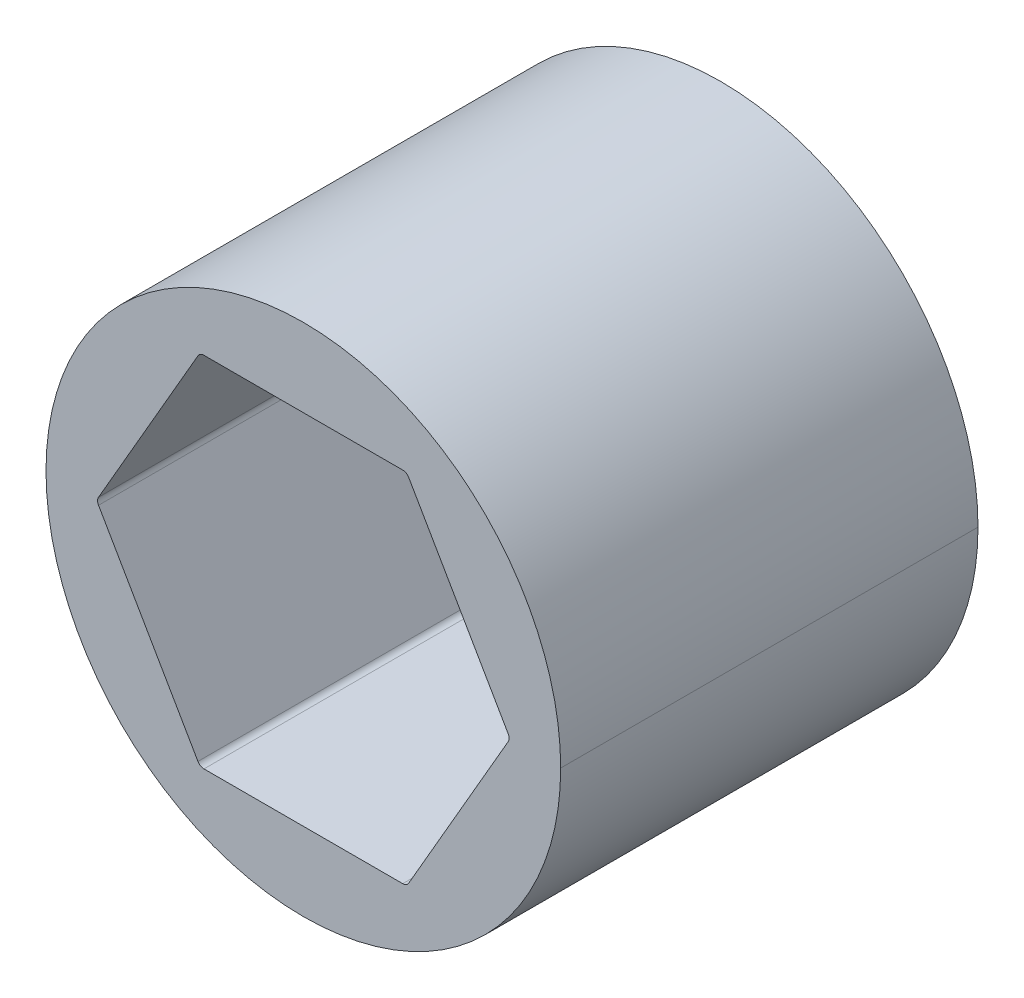
ISO-10303-21;
HEADER;
FILE_DESCRIPTION(('STEP AP214'),'2;1');
FILE_NAME('part.step','',(''),(''),'','','');
FILE_SCHEMA(('AUTOMOTIVE_DESIGN { 1 0 10303 214 1 1 1 1 }'));
ENDSEC;
DATA;
#1=APPLICATION_CONTEXT('core data for automotive mechanical design processes');
#2=APPLICATION_PROTOCOL_DEFINITION('international standard','automotive_design',2000,#1);
#3=PRODUCT_CONTEXT('',#1,'mechanical');
#4=PRODUCT('Part','Part','',(#3));
#5=PRODUCT_RELATED_PRODUCT_CATEGORY('part','',(#4));
#6=PRODUCT_DEFINITION_FORMATION('','',#4);
#7=PRODUCT_DEFINITION_CONTEXT('part definition',#1,'design');
#8=PRODUCT_DEFINITION('design','',#6,#7);
#9=PRODUCT_DEFINITION_SHAPE('','',#8);
#10=(LENGTH_UNIT() NAMED_UNIT(*) SI_UNIT(.MILLI.,.METRE.));
#11=(NAMED_UNIT(*) PLANE_ANGLE_UNIT() SI_UNIT($,.RADIAN.));
#12=(NAMED_UNIT(*) SI_UNIT($,.STERADIAN.) SOLID_ANGLE_UNIT());
#13=UNCERTAINTY_MEASURE_WITH_UNIT(LENGTH_MEASURE(1.E-05),#10,'distance_accuracy_value','');
#14=(GEOMETRIC_REPRESENTATION_CONTEXT(3) GLOBAL_UNCERTAINTY_ASSIGNED_CONTEXT((#13)) GLOBAL_UNIT_ASSIGNED_CONTEXT((#10,
#11,#12)) REPRESENTATION_CONTEXT('',''));
#15=CARTESIAN_POINT('',(0.,0.,0.));
#16=DIRECTION('',(0.,0.,1.));
#17=DIRECTION('',(1.,0.,0.));
#18=AXIS2_PLACEMENT_3D('',#15,#16,#17);
#19=CARTESIAN_POINT('',(7.25902493452117,0.,30.48));
#20=DIRECTION('',(0.,0.,1.));
#21=DIRECTION('',(1.,0.,0.));
#22=AXIS2_PLACEMENT_3D('',#19,#20,#21);
#23=CYLINDRICAL_SURFACE('',#22,0.254);
#24=CARTESIAN_POINT('',(7.25902493452117,0.,15.24));
#25=DIRECTION('',(0.,0.,1.));
#26=DIRECTION('',(1.,0.,0.));
#27=AXIS2_PLACEMENT_3D('',#24,#25,#26);
#28=CIRCLE('',#27,0.254);
#29=CARTESIAN_POINT('',(7.47899538708242,0.127,15.24));
#30=VERTEX_POINT('',#29);
#31=CARTESIAN_POINT('',(7.51302493452117,0.,15.24));
#32=VERTEX_POINT('',#31);
#33=EDGE_CURVE('E303',#30,#32,#28,.F.);
#34=ORIENTED_EDGE('',*,*,#33,.F.);
#35=DIRECTION('',(0.,0.,1.));
#36=VECTOR('',#35,1.);
#37=CARTESIAN_POINT('',(7.47899538708242,0.127,30.48));
#38=LINE('',#37,#36);
#39=CARTESIAN_POINT('',(7.47899538708242,0.127,0.));
#40=VERTEX_POINT('',#39);
#41=EDGE_CURVE('E269',#40,#30,#38,.T.);
#42=ORIENTED_EDGE('',*,*,#41,.F.);
#43=CARTESIAN_POINT('',(7.25902493452117,0.,0.));
#44=DIRECTION('',(0.,0.,1.));
#45=DIRECTION('',(1.,0.,0.));
#46=AXIS2_PLACEMENT_3D('',#43,#44,#45);
#47=CIRCLE('',#46,0.254);
#48=CARTESIAN_POINT('',(7.51302493452117,0.,0.));
#49=VERTEX_POINT('',#48);
#50=EDGE_CURVE('E201',#49,#40,#47,.T.);
#51=ORIENTED_EDGE('',*,*,#50,.F.);
#52=DIRECTION('',(0.,0.,1.));
#53=VECTOR('',#52,1.);
#54=CARTESIAN_POINT('',(7.51302493452117,0.,30.48));
#55=LINE('',#54,#53);
#56=EDGE_CURVE('E54',#49,#32,#55,.T.);
#57=ORIENTED_EDGE('',*,*,#56,.T.);
#58=EDGE_LOOP('',(#34,#42,#51,#57));
#59=FACE_BOUND('',#58,.T.);
#60=ADVANCED_FACE('F45',(#59),#23,.F.);
#61=CARTESIAN_POINT('',(0.,0.,30.48));
#62=DIRECTION('',(0.,0.,-1.));
#63=DIRECTION('',(-1.,0.,0.));
#64=AXIS2_PLACEMENT_3D('',#61,#62,#63);
#65=CYLINDRICAL_SURFACE('',#64,9.398);
#66=DIRECTION('',(0.,0.,-1.));
#67=VECTOR('',#66,1.);
#68=CARTESIAN_POINT('',(-9.398,0.,30.48));
#69=LINE('',#68,#67);
#70=CARTESIAN_POINT('',(-9.398,0.,15.24));
#71=VERTEX_POINT('',#70);
#72=CARTESIAN_POINT('',(-9.398,0.,0.));
#73=VERTEX_POINT('',#72);
#74=EDGE_CURVE('E176',#71,#73,#69,.T.);
#75=ORIENTED_EDGE('',*,*,#74,.F.);
#76=CARTESIAN_POINT('',(0.,0.,15.24));
#77=DIRECTION('',(0.,0.,1.));
#78=DIRECTION('',(1.,0.,0.));
#79=AXIS2_PLACEMENT_3D('',#76,#77,#78);
#80=CIRCLE('',#79,9.398);
#81=CARTESIAN_POINT('',(9.398,0.,15.24));
#82=VERTEX_POINT('',#81);
#83=EDGE_CURVE('E60',#82,#71,#80,.T.);
#84=ORIENTED_EDGE('',*,*,#83,.F.);
#85=DIRECTION('',(0.,0.,-1.));
#86=VECTOR('',#85,1.);
#87=CARTESIAN_POINT('',(9.398,0.,30.48));
#88=LINE('',#87,#86);
#89=CARTESIAN_POINT('',(9.398,0.,0.));
#90=VERTEX_POINT('',#89);
#91=EDGE_CURVE('E174',#82,#90,#88,.T.);
#92=ORIENTED_EDGE('',*,*,#91,.T.);
#93=CARTESIAN_POINT('',(0.,0.,0.));
#94=DIRECTION('',(0.,0.,1.));
#95=DIRECTION('',(1.,0.,0.));
#96=AXIS2_PLACEMENT_3D('',#93,#94,#95);
#97=CIRCLE('',#96,9.398);
#98=EDGE_CURVE('E183',#90,#73,#97,.T.);
#99=ORIENTED_EDGE('',*,*,#98,.T.);
#100=EDGE_LOOP('',(#75,#84,#92,#99));
#101=FACE_BOUND('',#100,.T.);
#102=ADVANCED_FACE('F172',(#101),#65,.T.);
#103=CARTESIAN_POINT('',(0.,0.,30.48));
#104=DIRECTION('',(0.,0.,-1.));
#105=DIRECTION('',(-1.,0.,0.));
#106=AXIS2_PLACEMENT_3D('',#103,#104,#105);
#107=CYLINDRICAL_SURFACE('',#106,9.398);
#108=ORIENTED_EDGE('',*,*,#91,.F.);
#109=EDGE_CURVE('E164',#71,#82,#80,.T.);
#110=ORIENTED_EDGE('',*,*,#109,.F.);
#111=ORIENTED_EDGE('',*,*,#74,.T.);
#112=CARTESIAN_POINT('',(0.,0.,0.));
#113=DIRECTION('',(0.,0.,1.));
#114=DIRECTION('',(1.,0.,0.));
#115=AXIS2_PLACEMENT_3D('',#112,#113,#114);
#116=CIRCLE('',#115,9.398);
#117=EDGE_CURVE('E181',#73,#90,#116,.T.);
#118=ORIENTED_EDGE('',*,*,#117,.T.);
#119=EDGE_LOOP('',(#108,#110,#111,#118));
#120=FACE_BOUND('',#119,.T.);
#121=ADVANCED_FACE('F179',(#120),#107,.T.);
#122=CARTESIAN_POINT('',(3.77615943563475,-6.5405,30.48));
#123=DIRECTION('',(-0.866025403784439,0.5,0.));
#124=DIRECTION('',(0.,0.,1.));
#125=AXIS2_PLACEMENT_3D('',#122,#123,#124);
#126=PLANE('',#125);
#127=DIRECTION('',(0.,0.,1.));
#128=VECTOR('',#127,1.);
#129=CARTESIAN_POINT('',(3.84948291982184,-6.4135,30.48));
#130=LINE('',#129,#128);
#131=CARTESIAN_POINT('',(3.84948291982184,-6.4135,0.));
#132=VERTEX_POINT('',#131);
#133=CARTESIAN_POINT('',(3.84948291982184,-6.4135,15.24));
#134=VERTEX_POINT('',#133);
#135=EDGE_CURVE('E220',#132,#134,#130,.T.);
#136=ORIENTED_EDGE('',*,*,#135,.T.);
#137=DIRECTION('',(0.5,0.866025403784439,0.));
#138=VECTOR('',#137,1.);
#139=CARTESIAN_POINT('',(3.77615943563475,-6.5405,15.24));
#140=LINE('',#139,#138);
#141=CARTESIAN_POINT('',(7.47899538708242,-0.127000000000001,15.24));
#142=VERTEX_POINT('',#141);
#143=EDGE_CURVE('E313',#134,#142,#140,.T.);
#144=ORIENTED_EDGE('',*,*,#143,.T.);
#145=DIRECTION('',(0.,0.,-1.));
#146=VECTOR('',#145,1.);
#147=CARTESIAN_POINT('',(7.47899538708242,-0.127,0.));
#148=LINE('',#147,#146);
#149=CARTESIAN_POINT('',(7.47899538708242,-0.127000000000001,0.));
#150=VERTEX_POINT('',#149);
#151=EDGE_CURVE('E224',#142,#150,#148,.T.);
#152=ORIENTED_EDGE('',*,*,#151,.T.);
#153=DIRECTION('',(0.5,0.866025403784439,0.));
#154=VECTOR('',#153,1.);
#155=CARTESIAN_POINT('',(3.77615943563475,-6.5405,0.));
#156=LINE('',#155,#154);
#157=EDGE_CURVE('E200',#132,#150,#156,.T.);
#158=ORIENTED_EDGE('',*,*,#157,.F.);
#159=EDGE_LOOP('',(#136,#144,#152,#158));
#160=FACE_BOUND('',#159,.T.);
#161=ADVANCED_FACE('F465',(#160),#126,.T.);
#162=CARTESIAN_POINT('',(7.5523188712695,0.,30.48));
#163=DIRECTION('',(-0.866025403784438,-0.5,0.));
#164=DIRECTION('',(-0.5,0.866025403784438,0.));
#165=AXIS2_PLACEMENT_3D('',#162,#163,#164);
#166=PLANE('',#165);
#167=ORIENTED_EDGE('',*,*,#41,.T.);
#168=DIRECTION('',(-0.5,0.866025403784438,0.));
#169=VECTOR('',#168,1.);
#170=CARTESIAN_POINT('',(7.5523188712695,0.,15.24));
#171=LINE('',#170,#169);
#172=CARTESIAN_POINT('',(3.84948291982183,6.4135,15.24));
#173=VERTEX_POINT('',#172);
#174=EDGE_CURVE('E298',#30,#173,#171,.T.);
#175=ORIENTED_EDGE('',*,*,#174,.T.);
#176=DIRECTION('',(0.,0.,-1.));
#177=VECTOR('',#176,1.);
#178=CARTESIAN_POINT('',(3.84948291982183,6.4135,0.));
#179=LINE('',#178,#177);
#180=CARTESIAN_POINT('',(3.84948291982183,6.4135,0.));
#181=VERTEX_POINT('',#180);
#182=EDGE_CURVE('E230',#173,#181,#179,.T.);
#183=ORIENTED_EDGE('',*,*,#182,.T.);
#184=DIRECTION('',(-0.5,0.866025403784438,0.));
#185=VECTOR('',#184,1.);
#186=CARTESIAN_POINT('',(7.5523188712695,0.,0.));
#187=LINE('',#186,#185);
#188=EDGE_CURVE('E228',#40,#181,#187,.T.);
#189=ORIENTED_EDGE('',*,*,#188,.F.);
#190=EDGE_LOOP('',(#167,#175,#183,#189));
#191=FACE_BOUND('',#190,.T.);
#192=ADVANCED_FACE('F297',(#191),#166,.T.);
#193=CARTESIAN_POINT('',(3.77615943563475,6.5405,30.48));
#194=DIRECTION('',(0.,-1.,0.));
#195=DIRECTION('',(0.,0.,-1.));
#196=AXIS2_PLACEMENT_3D('',#193,#194,#195);
#197=PLANE('',#196);
#198=DIRECTION('',(0.,0.,1.));
#199=VECTOR('',#198,1.);
#200=CARTESIAN_POINT('',(3.62951246726058,6.5405,30.48));
#201=LINE('',#200,#199);
#202=CARTESIAN_POINT('',(3.62951246726058,6.5405,0.));
#203=VERTEX_POINT('',#202);
#204=CARTESIAN_POINT('',(3.62951246726058,6.5405,15.24));
#205=VERTEX_POINT('',#204);
#206=EDGE_CURVE('E265',#203,#205,#201,.T.);
#207=ORIENTED_EDGE('',*,*,#206,.T.);
#208=DIRECTION('',(-1.,0.,0.));
#209=VECTOR('',#208,1.);
#210=CARTESIAN_POINT('',(3.77615943563475,6.5405,15.24));
#211=LINE('',#210,#209);
#212=CARTESIAN_POINT('',(-3.62951246726058,6.5405,15.24));
#213=VERTEX_POINT('',#212);
#214=EDGE_CURVE('E325',#205,#213,#211,.T.);
#215=ORIENTED_EDGE('',*,*,#214,.T.);
#216=DIRECTION('',(0.,0.,-1.));
#217=VECTOR('',#216,1.);
#218=CARTESIAN_POINT('',(-3.62951246726058,6.5405,0.));
#219=LINE('',#218,#217);
#220=CARTESIAN_POINT('',(-3.62951246726058,6.5405,0.));
#221=VERTEX_POINT('',#220);
#222=EDGE_CURVE('E270',#213,#221,#219,.T.);
#223=ORIENTED_EDGE('',*,*,#222,.T.);
#224=DIRECTION('',(-1.,0.,0.));
#225=VECTOR('',#224,1.);
#226=CARTESIAN_POINT('',(3.77615943563475,6.5405,0.));
#227=LINE('',#226,#225);
#228=EDGE_CURVE('E253',#203,#221,#227,.T.);
#229=ORIENTED_EDGE('',*,*,#228,.F.);
#230=EDGE_LOOP('',(#207,#215,#223,#229));
#231=FACE_BOUND('',#230,.T.);
#232=ADVANCED_FACE('F484',(#231),#197,.T.);
#233=CARTESIAN_POINT('',(-3.77615943563474,6.5405,30.48));
#234=DIRECTION('',(0.866025403784439,-0.5,0.));
#235=DIRECTION('',(0.,0.,-1.));
#236=AXIS2_PLACEMENT_3D('',#233,#234,#235);
#237=PLANE('',#236);
#238=DIRECTION('',(0.,0.,1.));
#239=VECTOR('',#238,1.);
#240=CARTESIAN_POINT('',(-3.84948291982183,6.4135,30.48));
#241=LINE('',#240,#239);
#242=CARTESIAN_POINT('',(-3.84948291982183,6.4135,0.));
#243=VERTEX_POINT('',#242);
#244=CARTESIAN_POINT('',(-3.84948291982183,6.4135,15.24));
#245=VERTEX_POINT('',#244);
#246=EDGE_CURVE('E194',#243,#245,#241,.T.);
#247=ORIENTED_EDGE('',*,*,#246,.T.);
#248=DIRECTION('',(-0.5,-0.866025403784439,0.));
#249=VECTOR('',#248,1.);
#250=CARTESIAN_POINT('',(-3.77615943563474,6.5405,15.24));
#251=LINE('',#250,#249);
#252=CARTESIAN_POINT('',(-7.47899538708242,0.127000000000006,15.24));
#253=VERTEX_POINT('',#252);
#254=EDGE_CURVE('E339',#245,#253,#251,.T.);
#255=ORIENTED_EDGE('',*,*,#254,.T.);
#256=DIRECTION('',(0.,0.,-1.));
#257=VECTOR('',#256,1.);
#258=CARTESIAN_POINT('',(-7.47899538708241,0.127000000000002,0.));
#259=LINE('',#258,#257);
#260=CARTESIAN_POINT('',(-7.47899538708241,0.127000000000003,0.));
#261=VERTEX_POINT('',#260);
#262=EDGE_CURVE('E243',#253,#261,#259,.T.);
#263=ORIENTED_EDGE('',*,*,#262,.T.);
#264=DIRECTION('',(-0.5,-0.866025403784439,0.));
#265=VECTOR('',#264,1.);
#266=CARTESIAN_POINT('',(-3.77615943563474,6.5405,0.));
#267=LINE('',#266,#265);
#268=EDGE_CURVE('E254',#243,#261,#267,.T.);
#269=ORIENTED_EDGE('',*,*,#268,.F.);
#270=EDGE_LOOP('',(#247,#255,#263,#269));
#271=FACE_BOUND('',#270,.T.);
#272=ADVANCED_FACE('F360',(#271),#237,.T.);
#273=CARTESIAN_POINT('',(-7.5523188712695,0.,30.48));
#274=DIRECTION('',(0.866025403784439,0.5,0.));
#275=DIRECTION('',(0.,0.,-1.));
#276=AXIS2_PLACEMENT_3D('',#273,#274,#275);
#277=PLANE('',#276);
#278=DIRECTION('',(0.,0.,1.));
#279=VECTOR('',#278,1.);
#280=CARTESIAN_POINT('',(-7.47899538708241,-0.126999999999998,30.48));
#281=LINE('',#280,#279);
#282=CARTESIAN_POINT('',(-7.47899538708241,-0.126999999999999,0.));
#283=VERTEX_POINT('',#282);
#284=CARTESIAN_POINT('',(-7.47899538708241,-0.126999999999998,15.24));
#285=VERTEX_POINT('',#284);
#286=EDGE_CURVE('E207',#283,#285,#281,.T.);
#287=ORIENTED_EDGE('',*,*,#286,.T.);
#288=DIRECTION('',(0.5,-0.866025403784439,0.));
#289=VECTOR('',#288,1.);
#290=CARTESIAN_POINT('',(-7.5523188712695,0.,15.24));
#291=LINE('',#290,#289);
#292=CARTESIAN_POINT('',(-3.84948291982184,-6.4135,15.24));
#293=VERTEX_POINT('',#292);
#294=EDGE_CURVE('E67',#285,#293,#291,.T.);
#295=ORIENTED_EDGE('',*,*,#294,.T.);
#296=DIRECTION('',(0.,0.,-1.));
#297=VECTOR('',#296,1.);
#298=CARTESIAN_POINT('',(-3.84948291982183,-6.4135,0.));
#299=LINE('',#298,#297);
#300=CARTESIAN_POINT('',(-3.84948291982183,-6.4135,0.));
#301=VERTEX_POINT('',#300);
#302=EDGE_CURVE('E211',#293,#301,#299,.T.);
#303=ORIENTED_EDGE('',*,*,#302,.T.);
#304=DIRECTION('',(0.5,-0.866025403784439,0.));
#305=VECTOR('',#304,1.);
#306=CARTESIAN_POINT('',(-7.5523188712695,0.,0.));
#307=LINE('',#306,#305);
#308=EDGE_CURVE('E219',#283,#301,#307,.T.);
#309=ORIENTED_EDGE('',*,*,#308,.F.);
#310=EDGE_LOOP('',(#287,#295,#303,#309));
#311=FACE_BOUND('',#310,.T.);
#312=ADVANCED_FACE('F346',(#311),#277,.T.);
#313=CARTESIAN_POINT('',(-3.77615943563474,-6.5405,30.48));
#314=DIRECTION('',(0.,1.,0.));
#315=DIRECTION('',(1.,0.,0.));
#316=AXIS2_PLACEMENT_3D('',#313,#314,#315);
#317=PLANE('',#316);
#318=DIRECTION('',(0.,0.,1.));
#319=VECTOR('',#318,1.);
#320=CARTESIAN_POINT('',(-3.62951246726058,-6.5405,30.48));
#321=LINE('',#320,#319);
#322=CARTESIAN_POINT('',(-3.62951246726058,-6.5405,0.));
#323=VERTEX_POINT('',#322);
#324=CARTESIAN_POINT('',(-3.62951246726058,-6.5405,15.24));
#325=VERTEX_POINT('',#324);
#326=EDGE_CURVE('E205',#323,#325,#321,.T.);
#327=ORIENTED_EDGE('',*,*,#326,.T.);
#328=DIRECTION('',(1.,0.,0.));
#329=VECTOR('',#328,1.);
#330=CARTESIAN_POINT('',(-3.77615943563474,-6.5405,15.24));
#331=LINE('',#330,#329);
#332=CARTESIAN_POINT('',(3.62951246726059,-6.5405,15.24));
#333=VERTEX_POINT('',#332);
#334=EDGE_CURVE('E329',#325,#333,#331,.T.);
#335=ORIENTED_EDGE('',*,*,#334,.T.);
#336=DIRECTION('',(0.,0.,-1.));
#337=VECTOR('',#336,1.);
#338=CARTESIAN_POINT('',(3.62951246726059,-6.5405,0.));
#339=LINE('',#338,#337);
#340=CARTESIAN_POINT('',(3.62951246726058,-6.5405,0.));
#341=VERTEX_POINT('',#340);
#342=EDGE_CURVE('E202',#333,#341,#339,.T.);
#343=ORIENTED_EDGE('',*,*,#342,.T.);
#344=DIRECTION('',(1.,0.,0.));
#345=VECTOR('',#344,1.);
#346=CARTESIAN_POINT('',(-3.77615943563474,-6.5405,0.));
#347=LINE('',#346,#345);
#348=EDGE_CURVE('E190',#323,#341,#347,.T.);
#349=ORIENTED_EDGE('',*,*,#348,.F.);
#350=EDGE_LOOP('',(#327,#335,#343,#349));
#351=FACE_BOUND('',#350,.T.);
#352=ADVANCED_FACE('F510',(#351),#317,.T.);
#353=CARTESIAN_POINT('',(3.62951246726058,6.2865,30.48));
#354=DIRECTION('',(0.,0.,1.));
#355=DIRECTION('',(1.,0.,0.));
#356=AXIS2_PLACEMENT_3D('',#353,#354,#355);
#357=CYLINDRICAL_SURFACE('',#356,0.254);
#358=CARTESIAN_POINT('',(3.62951246726058,6.2865,15.24));
#359=DIRECTION('',(0.,0.,1.));
#360=DIRECTION('',(1.,0.,0.));
#361=AXIS2_PLACEMENT_3D('',#358,#359,#360);
#362=CIRCLE('',#361,0.254);
#363=EDGE_CURVE('E319',#205,#173,#362,.F.);
#364=ORIENTED_EDGE('',*,*,#363,.F.);
#365=ORIENTED_EDGE('',*,*,#206,.F.);
#366=CARTESIAN_POINT('',(3.62951246726058,6.2865,0.));
#367=DIRECTION('',(0.,0.,1.));
#368=DIRECTION('',(1.,0.,0.));
#369=AXIS2_PLACEMENT_3D('',#366,#367,#368);
#370=CIRCLE('',#369,0.254);
#371=EDGE_CURVE('E258',#181,#203,#370,.T.);
#372=ORIENTED_EDGE('',*,*,#371,.F.);
#373=ORIENTED_EDGE('',*,*,#182,.F.);
#374=EDGE_LOOP('',(#364,#365,#372,#373));
#375=FACE_BOUND('',#374,.T.);
#376=ADVANCED_FACE('F519',(#375),#357,.F.);
#377=CARTESIAN_POINT('',(-3.62951246726058,6.2865,30.48));
#378=DIRECTION('',(0.,0.,1.));
#379=DIRECTION('',(1.,0.,0.));
#380=AXIS2_PLACEMENT_3D('',#377,#378,#379);
#381=CYLINDRICAL_SURFACE('',#380,0.254);
#382=CARTESIAN_POINT('',(-3.62951246726058,6.2865,15.24));
#383=DIRECTION('',(0.,0.,1.));
#384=DIRECTION('',(1.,0.,0.));
#385=AXIS2_PLACEMENT_3D('',#382,#383,#384);
#386=CIRCLE('',#385,0.254);
#387=EDGE_CURVE('E333',#245,#213,#386,.F.);
#388=ORIENTED_EDGE('',*,*,#387,.F.);
#389=ORIENTED_EDGE('',*,*,#246,.F.);
#390=CARTESIAN_POINT('',(-3.62951246726058,6.2865,0.));
#391=DIRECTION('',(0.,0.,1.));
#392=DIRECTION('',(1.,0.,0.));
#393=AXIS2_PLACEMENT_3D('',#390,#391,#392);
#394=CIRCLE('',#393,0.254);
#395=EDGE_CURVE('E249',#221,#243,#394,.T.);
#396=ORIENTED_EDGE('',*,*,#395,.F.);
#397=ORIENTED_EDGE('',*,*,#222,.F.);
#398=EDGE_LOOP('',(#388,#389,#396,#397));
#399=FACE_BOUND('',#398,.T.);
#400=ADVANCED_FACE('F528',(#399),#381,.F.);
#401=CARTESIAN_POINT('',(-3.62951246726058,-6.2865,30.48));
#402=DIRECTION('',(0.,0.,1.));
#403=DIRECTION('',(1.,0.,0.));
#404=AXIS2_PLACEMENT_3D('',#401,#402,#403);
#405=CYLINDRICAL_SURFACE('',#404,0.254);
#406=CARTESIAN_POINT('',(-3.62951246726058,-6.2865,15.24));
#407=DIRECTION('',(0.,0.,1.));
#408=DIRECTION('',(1.,0.,0.));
#409=AXIS2_PLACEMENT_3D('',#406,#407,#408);
#410=CIRCLE('',#409,0.254);
#411=EDGE_CURVE('E336',#325,#293,#410,.F.);
#412=ORIENTED_EDGE('',*,*,#411,.F.);
#413=ORIENTED_EDGE('',*,*,#326,.F.);
#414=CARTESIAN_POINT('',(-3.62951246726058,-6.2865,0.));
#415=DIRECTION('',(0.,0.,1.));
#416=DIRECTION('',(1.,0.,0.));
#417=AXIS2_PLACEMENT_3D('',#414,#415,#416);
#418=CIRCLE('',#417,0.254);
#419=EDGE_CURVE('E216',#301,#323,#418,.T.);
#420=ORIENTED_EDGE('',*,*,#419,.F.);
#421=ORIENTED_EDGE('',*,*,#302,.F.);
#422=EDGE_LOOP('',(#412,#413,#420,#421));
#423=FACE_BOUND('',#422,.T.);
#424=ADVANCED_FACE('F351',(#423),#405,.F.);
#425=CARTESIAN_POINT('',(3.62951246726059,-6.2865,30.48));
#426=DIRECTION('',(0.,0.,1.));
#427=DIRECTION('',(1.,0.,0.));
#428=AXIS2_PLACEMENT_3D('',#425,#426,#427);
#429=CYLINDRICAL_SURFACE('',#428,0.254);
#430=CARTESIAN_POINT('',(3.62951246726059,-6.2865,15.24));
#431=DIRECTION('',(0.,0.,1.));
#432=DIRECTION('',(1.,0.,0.));
#433=AXIS2_PLACEMENT_3D('',#430,#431,#432);
#434=CIRCLE('',#433,0.254);
#435=EDGE_CURVE('E322',#134,#333,#434,.F.);
#436=ORIENTED_EDGE('',*,*,#435,.F.);
#437=ORIENTED_EDGE('',*,*,#135,.F.);
#438=CARTESIAN_POINT('',(3.62951246726059,-6.2865,0.));
#439=DIRECTION('',(0.,0.,1.));
#440=DIRECTION('',(1.,0.,0.));
#441=AXIS2_PLACEMENT_3D('',#438,#439,#440);
#442=CIRCLE('',#441,0.254);
#443=EDGE_CURVE('E212',#341,#132,#442,.T.);
#444=ORIENTED_EDGE('',*,*,#443,.F.);
#445=ORIENTED_EDGE('',*,*,#342,.F.);
#446=EDGE_LOOP('',(#436,#437,#444,#445));
#447=FACE_BOUND('',#446,.T.);
#448=ADVANCED_FACE('F394',(#447),#429,.F.);
#449=CARTESIAN_POINT('',(7.25902493452117,0.,30.48));
#450=DIRECTION('',(0.,0.,1.));
#451=DIRECTION('',(1.,0.,0.));
#452=AXIS2_PLACEMENT_3D('',#449,#450,#451);
#453=CYLINDRICAL_SURFACE('',#452,0.254);
#454=CARTESIAN_POINT('',(7.25902493452117,0.,15.24));
#455=DIRECTION('',(0.,0.,1.));
#456=DIRECTION('',(1.,0.,0.));
#457=AXIS2_PLACEMENT_3D('',#454,#455,#456);
#458=CIRCLE('',#457,0.254);
#459=EDGE_CURVE('E206',#32,#142,#458,.F.);
#460=ORIENTED_EDGE('',*,*,#459,.F.);
#461=ORIENTED_EDGE('',*,*,#56,.F.);
#462=CARTESIAN_POINT('',(7.25902493452117,0.,0.));
#463=DIRECTION('',(0.,0.,1.));
#464=DIRECTION('',(1.,0.,0.));
#465=AXIS2_PLACEMENT_3D('',#462,#463,#464);
#466=CIRCLE('',#465,0.254);
#467=EDGE_CURVE('E196',#150,#49,#466,.T.);
#468=ORIENTED_EDGE('',*,*,#467,.F.);
#469=ORIENTED_EDGE('',*,*,#151,.F.);
#470=EDGE_LOOP('',(#460,#461,#468,#469));
#471=FACE_BOUND('',#470,.T.);
#472=ADVANCED_FACE('F309',(#471),#453,.F.);
#473=CARTESIAN_POINT('',(-7.25902493452117,0.,30.48));
#474=DIRECTION('',(0.,0.,1.));
#475=DIRECTION('',(1.,0.,0.));
#476=AXIS2_PLACEMENT_3D('',#473,#474,#475);
#477=CYLINDRICAL_SURFACE('',#476,0.254);
#478=CARTESIAN_POINT('',(-7.25902493452117,0.,15.24));
#479=DIRECTION('',(0.,0.,1.));
#480=DIRECTION('',(1.,0.,0.));
#481=AXIS2_PLACEMENT_3D('',#478,#479,#480);
#482=CIRCLE('',#481,0.254);
#483=EDGE_CURVE('E11',#285,#253,#482,.F.);
#484=ORIENTED_EDGE('',*,*,#483,.F.);
#485=ORIENTED_EDGE('',*,*,#286,.F.);
#486=CARTESIAN_POINT('',(-7.25902493452117,0.,0.));
#487=DIRECTION('',(0.,0.,1.));
#488=DIRECTION('',(1.,0.,0.));
#489=AXIS2_PLACEMENT_3D('',#486,#487,#488);
#490=CIRCLE('',#489,0.254);
#491=EDGE_CURVE('E240',#261,#283,#490,.T.);
#492=ORIENTED_EDGE('',*,*,#491,.F.);
#493=ORIENTED_EDGE('',*,*,#262,.F.);
#494=EDGE_LOOP('',(#484,#485,#492,#493));
#495=FACE_BOUND('',#494,.T.);
#496=ADVANCED_FACE('F47',(#495),#477,.F.);
#497=CARTESIAN_POINT('',(0.,0.,0.));
#498=DIRECTION('',(0.,0.,1.));
#499=DIRECTION('',(1.,0.,0.));
#500=AXIS2_PLACEMENT_3D('',#497,#498,#499);
#501=PLANE('',#500);
#502=ORIENTED_EDGE('',*,*,#117,.F.);
#503=ORIENTED_EDGE('',*,*,#98,.F.);
#504=EDGE_LOOP('',(#502,#503));
#505=FACE_BOUND('',#504,.T.);
#506=ORIENTED_EDGE('',*,*,#348,.T.);
#507=ORIENTED_EDGE('',*,*,#443,.T.);
#508=ORIENTED_EDGE('',*,*,#157,.T.);
#509=ORIENTED_EDGE('',*,*,#467,.T.);
#510=ORIENTED_EDGE('',*,*,#50,.T.);
#511=ORIENTED_EDGE('',*,*,#188,.T.);
#512=ORIENTED_EDGE('',*,*,#371,.T.);
#513=ORIENTED_EDGE('',*,*,#228,.T.);
#514=ORIENTED_EDGE('',*,*,#395,.T.);
#515=ORIENTED_EDGE('',*,*,#268,.T.);
#516=ORIENTED_EDGE('',*,*,#491,.T.);
#517=ORIENTED_EDGE('',*,*,#308,.T.);
#518=ORIENTED_EDGE('',*,*,#419,.T.);
#519=EDGE_LOOP('',(#506,#507,#508,#509,#510,#511,#512,#513,#514,#515,#516,#517,#518));
#520=FACE_BOUND('',#519,.T.);
#521=ADVANCED_FACE('F304',(#505,#520),#501,.F.);
#522=CARTESIAN_POINT('',(0.,0.,15.24));
#523=DIRECTION('',(0.,0.,1.));
#524=DIRECTION('',(1.,0.,0.));
#525=AXIS2_PLACEMENT_3D('',#522,#523,#524);
#526=PLANE('',#525);
#527=ORIENTED_EDGE('',*,*,#83,.T.);
#528=ORIENTED_EDGE('',*,*,#109,.T.);
#529=EDGE_LOOP('',(#527,#528));
#530=FACE_BOUND('',#529,.T.);
#531=ORIENTED_EDGE('',*,*,#459,.T.);
#532=ORIENTED_EDGE('',*,*,#143,.F.);
#533=ORIENTED_EDGE('',*,*,#435,.T.);
#534=ORIENTED_EDGE('',*,*,#334,.F.);
#535=ORIENTED_EDGE('',*,*,#411,.T.);
#536=ORIENTED_EDGE('',*,*,#294,.F.);
#537=ORIENTED_EDGE('',*,*,#483,.T.);
#538=ORIENTED_EDGE('',*,*,#254,.F.);
#539=ORIENTED_EDGE('',*,*,#387,.T.);
#540=ORIENTED_EDGE('',*,*,#214,.F.);
#541=ORIENTED_EDGE('',*,*,#363,.T.);
#542=ORIENTED_EDGE('',*,*,#174,.F.);
#543=ORIENTED_EDGE('',*,*,#33,.T.);
#544=EDGE_LOOP('',(#531,#532,#533,#534,#535,#536,#537,#538,#539,#540,#541,#542,#543));
#545=FACE_BOUND('',#544,.T.);
#546=ADVANCED_FACE('F165',(#530,#545),#526,.T.);
#547=CLOSED_SHELL('',(#60,#102,#121,#161,#192,#232,#272,#312,#352,#376,#400,#424,#448,#472,#496,
#521,#546));
#548=MANIFOLD_SOLID_BREP('B2',#547);
#549=ADVANCED_BREP_SHAPE_REPRESENTATION('',(#18,#548),#14);
#550=SHAPE_DEFINITION_REPRESENTATION(#9,#549);
ENDSEC;
END-ISO-10303-21;
